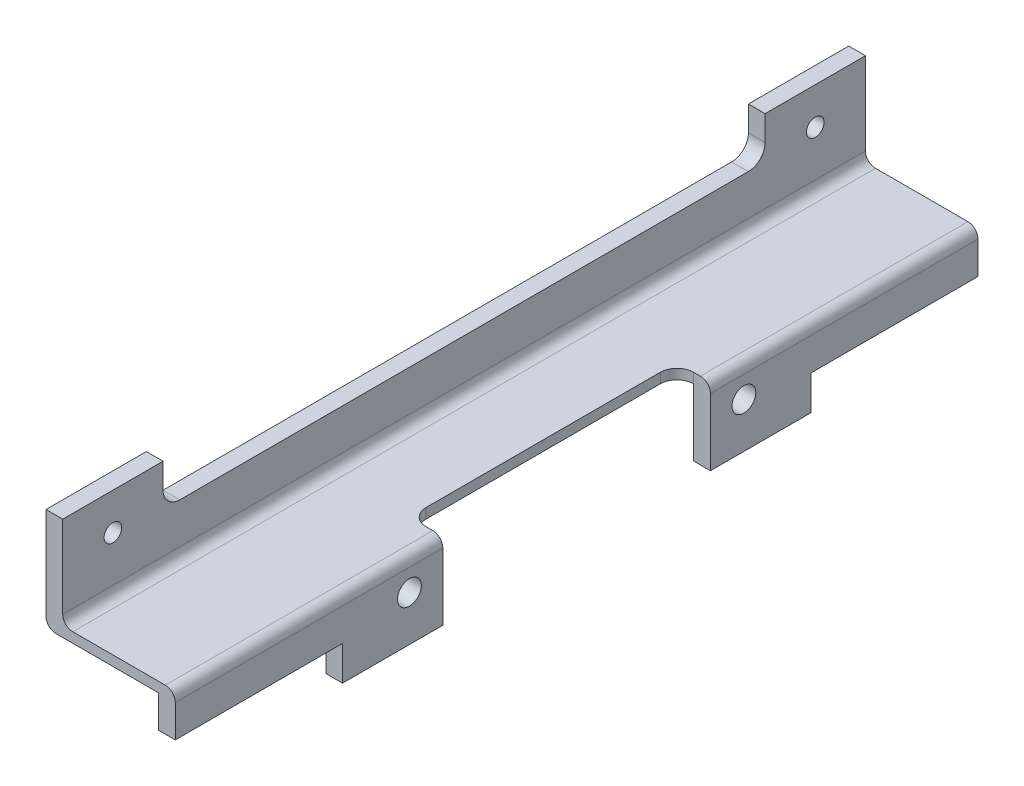
ISO-10303-21;
HEADER;
FILE_DESCRIPTION(('STEP AP214'),'2;1');
FILE_NAME('part.step','',(''),(''),'','','');
FILE_SCHEMA(('AUTOMOTIVE_DESIGN { 1 0 10303 214 1 1 1 1 }'));
ENDSEC;
DATA;
#1=APPLICATION_CONTEXT('core data for automotive mechanical design processes');
#2=APPLICATION_PROTOCOL_DEFINITION('international standard','automotive_design',2000,#1);
#3=PRODUCT_CONTEXT('',#1,'mechanical');
#4=PRODUCT('Part','Part','',(#3));
#5=PRODUCT_RELATED_PRODUCT_CATEGORY('part','',(#4));
#6=PRODUCT_DEFINITION_FORMATION('','',#4);
#7=PRODUCT_DEFINITION_CONTEXT('part definition',#1,'design');
#8=PRODUCT_DEFINITION('design','',#6,#7);
#9=PRODUCT_DEFINITION_SHAPE('','',#8);
#10=(LENGTH_UNIT() NAMED_UNIT(*) SI_UNIT(.MILLI.,.METRE.));
#11=(NAMED_UNIT(*) PLANE_ANGLE_UNIT() SI_UNIT($,.RADIAN.));
#12=(NAMED_UNIT(*) SI_UNIT($,.STERADIAN.) SOLID_ANGLE_UNIT());
#13=UNCERTAINTY_MEASURE_WITH_UNIT(LENGTH_MEASURE(1.E-05),#10,'distance_accuracy_value','');
#14=(GEOMETRIC_REPRESENTATION_CONTEXT(3) GLOBAL_UNCERTAINTY_ASSIGNED_CONTEXT((#13)) GLOBAL_UNIT_ASSIGNED_CONTEXT((#10,
#11,#12)) REPRESENTATION_CONTEXT('',''));
#15=CARTESIAN_POINT('',(0.,0.,0.));
#16=DIRECTION('',(0.,0.,1.));
#17=DIRECTION('',(1.,0.,0.));
#18=AXIS2_PLACEMENT_3D('',#15,#16,#17);
#19=CARTESIAN_POINT('',(6.35,50.8,-240.));
#20=DIRECTION('',(0.,0.,-1.));
#21=DIRECTION('',(-1.,0.,0.));
#22=AXIS2_PLACEMENT_3D('',#19,#20,#21);
#23=PLANE('',#22);
#24=DIRECTION('',(1.,0.,0.));
#25=VECTOR('',#24,1.);
#26=CARTESIAN_POINT('',(0.,6.35,-240.));
#27=LINE('',#26,#25);
#28=CARTESIAN_POINT('',(37.,6.35,-240.));
#29=VERTEX_POINT('',#28);
#30=CARTESIAN_POINT('',(9.35,6.35,-240.));
#31=VERTEX_POINT('',#30);
#32=EDGE_CURVE('E613',#29,#31,#27,.F.);
#33=ORIENTED_EDGE('',*,*,#32,.F.);
#34=CARTESIAN_POINT('',(37.,3.35,-240.));
#35=DIRECTION('',(0.,0.,-1.));
#36=DIRECTION('',(-1.,0.,0.));
#37=AXIS2_PLACEMENT_3D('',#34,#35,#36);
#38=CIRCLE('',#37,3.);
#39=CARTESIAN_POINT('',(40.,3.35,-240.));
#40=VERTEX_POINT('',#39);
#41=EDGE_CURVE('E263',#29,#40,#38,.T.);
#42=ORIENTED_EDGE('',*,*,#41,.T.);
#43=DIRECTION('',(0.,1.,0.));
#44=VECTOR('',#43,1.);
#45=CARTESIAN_POINT('',(40.,6.35,-240.));
#46=LINE('',#45,#44);
#47=CARTESIAN_POINT('',(40.,-6.35,-240.));
#48=VERTEX_POINT('',#47);
#49=EDGE_CURVE('E256',#48,#40,#46,.T.);
#50=ORIENTED_EDGE('',*,*,#49,.F.);
#51=DIRECTION('',(-1.,0.,0.));
#52=VECTOR('',#51,1.);
#53=CARTESIAN_POINT('',(40.,-6.35,-240.));
#54=LINE('',#53,#52);
#55=CARTESIAN_POINT('',(35.,-6.35,-240.));
#56=VERTEX_POINT('',#55);
#57=EDGE_CURVE('E237',#48,#56,#54,.T.);
#58=ORIENTED_EDGE('',*,*,#57,.T.);
#59=DIRECTION('',(0.,-1.,0.));
#60=VECTOR('',#59,1.);
#61=CARTESIAN_POINT('',(35.,6.35,-240.));
#62=LINE('',#61,#60);
#63=CARTESIAN_POINT('',(35.,3.35,-240.));
#64=VERTEX_POINT('',#63);
#65=EDGE_CURVE('E279',#64,#56,#62,.T.);
#66=ORIENTED_EDGE('',*,*,#65,.F.);
#67=DIRECTION('',(1.,0.,0.));
#68=VECTOR('',#67,1.);
#69=CARTESIAN_POINT('',(32.,3.35,-240.));
#70=LINE('',#69,#68);
#71=CARTESIAN_POINT('',(4.35,3.35,-240.));
#72=VERTEX_POINT('',#71);
#73=EDGE_CURVE('E398',#72,#64,#70,.T.);
#74=ORIENTED_EDGE('',*,*,#73,.F.);
#75=CARTESIAN_POINT('',(4.35,6.35,-240.));
#76=DIRECTION('',(0.,0.,-1.));
#77=DIRECTION('',(-1.,0.,0.));
#78=AXIS2_PLACEMENT_3D('',#75,#76,#77);
#79=CIRCLE('',#78,3.);
#80=CARTESIAN_POINT('',(1.35,6.35,-240.));
#81=VERTEX_POINT('',#80);
#82=EDGE_CURVE('E397',#72,#81,#79,.T.);
#83=ORIENTED_EDGE('',*,*,#82,.T.);
#84=DIRECTION('',(0.,-1.,0.));
#85=VECTOR('',#84,1.);
#86=CARTESIAN_POINT('',(1.35,0.,-240.));
#87=LINE('',#86,#85);
#88=CARTESIAN_POINT('',(1.35,34.,-240.));
#89=VERTEX_POINT('',#88);
#90=EDGE_CURVE('E450',#89,#81,#87,.T.);
#91=ORIENTED_EDGE('',*,*,#90,.F.);
#92=DIRECTION('',(-1.,0.,0.));
#93=VECTOR('',#92,1.);
#94=CARTESIAN_POINT('',(6.35,34.,-240.));
#95=LINE('',#94,#93);
#96=CARTESIAN_POINT('',(6.35,34.,-240.));
#97=VERTEX_POINT('',#96);
#98=EDGE_CURVE('E601',#97,#89,#95,.T.);
#99=ORIENTED_EDGE('',*,*,#98,.F.);
#100=DIRECTION('',(0.,1.,0.));
#101=VECTOR('',#100,1.);
#102=CARTESIAN_POINT('',(6.35,0.,-240.));
#103=LINE('',#102,#101);
#104=CARTESIAN_POINT('',(6.35,9.35,-240.));
#105=VERTEX_POINT('',#104);
#106=EDGE_CURVE('E610',#105,#97,#103,.T.);
#107=ORIENTED_EDGE('',*,*,#106,.F.);
#108=CARTESIAN_POINT('',(9.35,9.35,-240.));
#109=DIRECTION('',(0.,0.,-1.));
#110=DIRECTION('',(-1.,0.,0.));
#111=AXIS2_PLACEMENT_3D('',#108,#109,#110);
#112=CIRCLE('',#111,3.);
#113=EDGE_CURVE('E623',#105,#31,#112,.F.);
#114=ORIENTED_EDGE('',*,*,#113,.T.);
#115=EDGE_LOOP('',(#33,#42,#50,#58,#66,#74,#83,#91,#99,#107,#114));
#116=FACE_BOUND('',#115,.T.);
#117=ADVANCED_FACE('F47',(#116),#23,.T.);
#118=CARTESIAN_POINT('',(35.,6.35,-263.53720459188));
#119=DIRECTION('',(-1.,0.,0.));
#120=DIRECTION('',(0.,0.,1.));
#121=AXIS2_PLACEMENT_3D('',#118,#119,#120);
#122=PLANE('',#121);
#123=CARTESIAN_POINT('',(35.,-3.15,-170.));
#124=DIRECTION('',(-1.,0.,0.));
#125=DIRECTION('',(0.,0.,1.));
#126=AXIS2_PLACEMENT_3D('',#123,#124,#125);
#127=CIRCLE('',#126,3.56870000000001);
#128=CARTESIAN_POINT('',(35.,-3.15,-166.4313));
#129=VERTEX_POINT('',#128);
#130=EDGE_CURVE('E290',#129,#129,#127,.T.);
#131=ORIENTED_EDGE('',*,*,#130,.F.);
#132=EDGE_LOOP('',(#131));
#133=FACE_BOUND('',#132,.T.);
#134=ORIENTED_EDGE('',*,*,#65,.T.);
#135=DIRECTION('',(0.,0.,1.));
#136=VECTOR('',#135,1.);
#137=CARTESIAN_POINT('',(35.,-6.35,-263.53720459188));
#138=LINE('',#137,#136);
#139=CARTESIAN_POINT('',(35.,-6.35000000000001,-190.));
#140=VERTEX_POINT('',#139);
#141=EDGE_CURVE('E244',#56,#140,#138,.T.);
#142=ORIENTED_EDGE('',*,*,#141,.T.);
#143=DIRECTION('',(0.,-1.,0.));
#144=VECTOR('',#143,1.);
#145=CARTESIAN_POINT('',(35.,6.35,-190.));
#146=LINE('',#145,#144);
#147=CARTESIAN_POINT('',(35.,-16.65,-190.));
#148=VERTEX_POINT('',#147);
#149=EDGE_CURVE('E249',#140,#148,#146,.T.);
#150=ORIENTED_EDGE('',*,*,#149,.T.);
#151=DIRECTION('',(0.,0.,1.));
#152=VECTOR('',#151,1.);
#153=CARTESIAN_POINT('',(35.,-16.65,-263.53720459188));
#154=LINE('',#153,#152);
#155=CARTESIAN_POINT('',(35.,-16.65,-160.));
#156=VERTEX_POINT('',#155);
#157=EDGE_CURVE('E283',#148,#156,#154,.T.);
#158=ORIENTED_EDGE('',*,*,#157,.T.);
#159=DIRECTION('',(0.,-1.,0.));
#160=VECTOR('',#159,1.);
#161=CARTESIAN_POINT('',(35.,6.35,-160.));
#162=LINE('',#161,#160);
#163=CARTESIAN_POINT('',(35.,3.35,-160.));
#164=VERTEX_POINT('',#163);
#165=EDGE_CURVE('E315',#164,#156,#162,.T.);
#166=ORIENTED_EDGE('',*,*,#165,.F.);
#167=DIRECTION('',(0.,0.,-1.));
#168=VECTOR('',#167,1.);
#169=CARTESIAN_POINT('',(35.,3.35,-240.));
#170=LINE('',#169,#168);
#171=EDGE_CURVE('E264',#164,#64,#170,.T.);
#172=ORIENTED_EDGE('',*,*,#171,.T.);
#173=EDGE_LOOP('',(#134,#142,#150,#158,#166,#172));
#174=FACE_BOUND('',#173,.T.);
#175=ADVANCED_FACE('F464',(#133,#174),#122,.T.);
#176=CARTESIAN_POINT('',(40.,-16.65,-263.53720459188));
#177=DIRECTION('',(0.,-1.,0.));
#178=DIRECTION('',(0.,0.,-1.));
#179=AXIS2_PLACEMENT_3D('',#176,#177,#178);
#180=PLANE('',#179);
#181=ORIENTED_EDGE('',*,*,#157,.F.);
#182=DIRECTION('',(-1.,0.,0.));
#183=VECTOR('',#182,1.);
#184=CARTESIAN_POINT('',(40.,-16.65,-190.));
#185=LINE('',#184,#183);
#186=CARTESIAN_POINT('',(40.,-16.65,-190.));
#187=VERTEX_POINT('',#186);
#188=EDGE_CURVE('E343',#187,#148,#185,.T.);
#189=ORIENTED_EDGE('',*,*,#188,.F.);
#190=DIRECTION('',(0.,0.,1.));
#191=VECTOR('',#190,1.);
#192=CARTESIAN_POINT('',(40.,-16.65,-263.53720459188));
#193=LINE('',#192,#191);
#194=CARTESIAN_POINT('',(40.,-16.65,-160.));
#195=VERTEX_POINT('',#194);
#196=EDGE_CURVE('E265',#187,#195,#193,.T.);
#197=ORIENTED_EDGE('',*,*,#196,.T.);
#198=DIRECTION('',(1.,0.,0.));
#199=VECTOR('',#198,1.);
#200=CARTESIAN_POINT('',(40.,-16.65,-160.));
#201=LINE('',#200,#199);
#202=EDGE_CURVE('E318',#156,#195,#201,.T.);
#203=ORIENTED_EDGE('',*,*,#202,.F.);
#204=EDGE_LOOP('',(#181,#189,#197,#203));
#205=FACE_BOUND('',#204,.T.);
#206=ADVANCED_FACE('F350',(#205),#180,.T.);
#207=CARTESIAN_POINT('',(40.,6.35,-263.53720459188));
#208=DIRECTION('',(1.,0.,0.));
#209=DIRECTION('',(0.,0.,-1.));
#210=AXIS2_PLACEMENT_3D('',#207,#208,#209);
#211=PLANE('',#210);
#212=CARTESIAN_POINT('',(40.,-3.15,-170.));
#213=DIRECTION('',(1.,0.,0.));
#214=DIRECTION('',(0.,0.,-1.));
#215=AXIS2_PLACEMENT_3D('',#212,#213,#214);
#216=CIRCLE('',#215,3.56870000000001);
#217=CARTESIAN_POINT('',(40.,-3.15,-173.5687));
#218=VERTEX_POINT('',#217);
#219=EDGE_CURVE('E293',#218,#218,#216,.T.);
#220=ORIENTED_EDGE('',*,*,#219,.F.);
#221=EDGE_LOOP('',(#220));
#222=FACE_BOUND('',#221,.T.);
#223=ORIENTED_EDGE('',*,*,#49,.T.);
#224=DIRECTION('',(0.,0.,1.));
#225=VECTOR('',#224,1.);
#226=CARTESIAN_POINT('',(40.,3.35,-263.53720459188));
#227=LINE('',#226,#225);
#228=CARTESIAN_POINT('',(40.,3.35,-160.));
#229=VERTEX_POINT('',#228);
#230=EDGE_CURVE('E355',#40,#229,#227,.T.);
#231=ORIENTED_EDGE('',*,*,#230,.T.);
#232=DIRECTION('',(0.,1.,0.));
#233=VECTOR('',#232,1.);
#234=CARTESIAN_POINT('',(40.,6.35,-160.));
#235=LINE('',#234,#233);
#236=EDGE_CURVE('E354',#195,#229,#235,.T.);
#237=ORIENTED_EDGE('',*,*,#236,.F.);
#238=ORIENTED_EDGE('',*,*,#196,.F.);
#239=DIRECTION('',(0.,-1.,0.));
#240=VECTOR('',#239,1.);
#241=CARTESIAN_POINT('',(40.,-16.65,-190.));
#242=LINE('',#241,#240);
#243=CARTESIAN_POINT('',(40.,-6.35000000000001,-190.));
#244=VERTEX_POINT('',#243);
#245=EDGE_CURVE('E259',#244,#187,#242,.T.);
#246=ORIENTED_EDGE('',*,*,#245,.F.);
#247=DIRECTION('',(0.,0.,1.));
#248=VECTOR('',#247,1.);
#249=CARTESIAN_POINT('',(40.,-6.35,-240.));
#250=LINE('',#249,#248);
#251=EDGE_CURVE('E241',#48,#244,#250,.T.);
#252=ORIENTED_EDGE('',*,*,#251,.F.);
#253=EDGE_LOOP('',(#223,#231,#237,#238,#246,#252));
#254=FACE_BOUND('',#253,.T.);
#255=ADVANCED_FACE('F254',(#222,#254),#211,.T.);
#256=CARTESIAN_POINT('',(35.,-3.15,-70.));
#257=DIRECTION('',(-1.,0.,0.));
#258=DIRECTION('',(0.,0.,1.));
#259=AXIS2_PLACEMENT_3D('',#256,#257,#258);
#260=CIRCLE('',#259,3.5687);
#261=CARTESIAN_POINT('',(35.,-3.15,-66.4313));
#262=VERTEX_POINT('',#261);
#263=EDGE_CURVE('E296',#262,#262,#260,.T.);
#264=ORIENTED_EDGE('',*,*,#263,.F.);
#265=EDGE_LOOP('',(#264));
#266=FACE_BOUND('',#265,.T.);
#267=CARTESIAN_POINT('',(35.,-16.65,-80.));
#268=VERTEX_POINT('',#267);
#269=CARTESIAN_POINT('',(35.,-16.65,-50.));
#270=VERTEX_POINT('',#269);
#271=EDGE_CURVE('E281',#268,#270,#154,.T.);
#272=ORIENTED_EDGE('',*,*,#271,.T.);
#273=DIRECTION('',(0.,1.,0.));
#274=VECTOR('',#273,1.);
#275=CARTESIAN_POINT('',(35.,6.35,-50.));
#276=LINE('',#275,#274);
#277=CARTESIAN_POINT('',(35.,-6.35,-50.));
#278=VERTEX_POINT('',#277);
#279=EDGE_CURVE('E321',#270,#278,#276,.T.);
#280=ORIENTED_EDGE('',*,*,#279,.T.);
#281=DIRECTION('',(0.,0.,1.));
#282=VECTOR('',#281,1.);
#283=CARTESIAN_POINT('',(35.,-6.35,-263.53720459188));
#284=LINE('',#283,#282);
#285=CARTESIAN_POINT('',(35.,-6.35,0.));
#286=VERTEX_POINT('',#285);
#287=EDGE_CURVE('E324',#278,#286,#284,.T.);
#288=ORIENTED_EDGE('',*,*,#287,.T.);
#289=DIRECTION('',(0.,-1.,0.));
#290=VECTOR('',#289,1.);
#291=CARTESIAN_POINT('',(35.,6.35,0.));
#292=LINE('',#291,#290);
#293=CARTESIAN_POINT('',(35.,3.35,0.));
#294=VERTEX_POINT('',#293);
#295=EDGE_CURVE('E282',#294,#286,#292,.T.);
#296=ORIENTED_EDGE('',*,*,#295,.F.);
#297=CARTESIAN_POINT('',(35.,3.35,-80.));
#298=VERTEX_POINT('',#297);
#299=EDGE_CURVE('E268',#294,#298,#170,.T.);
#300=ORIENTED_EDGE('',*,*,#299,.T.);
#301=DIRECTION('',(0.,1.,0.));
#302=VECTOR('',#301,1.);
#303=CARTESIAN_POINT('',(35.,6.34999999999996,-80.));
#304=LINE('',#303,#302);
#305=EDGE_CURVE('E308',#268,#298,#304,.T.);
#306=ORIENTED_EDGE('',*,*,#305,.F.);
#307=EDGE_LOOP('',(#272,#280,#288,#296,#300,#306));
#308=FACE_BOUND('',#307,.T.);
#309=ADVANCED_FACE('F417',(#266,#308),#122,.T.);
#310=CARTESIAN_POINT('',(40.,-16.65,-80.));
#311=VERTEX_POINT('',#310);
#312=CARTESIAN_POINT('',(40.,-16.65,-50.));
#313=VERTEX_POINT('',#312);
#314=EDGE_CURVE('E270',#311,#313,#193,.T.);
#315=ORIENTED_EDGE('',*,*,#314,.T.);
#316=DIRECTION('',(-1.,0.,0.));
#317=VECTOR('',#316,1.);
#318=CARTESIAN_POINT('',(40.,-16.65,-50.));
#319=LINE('',#318,#317);
#320=EDGE_CURVE('E327',#313,#270,#319,.T.);
#321=ORIENTED_EDGE('',*,*,#320,.T.);
#322=ORIENTED_EDGE('',*,*,#271,.F.);
#323=DIRECTION('',(-1.,0.,0.));
#324=VECTOR('',#323,1.);
#325=CARTESIAN_POINT('',(40.,-16.65,-80.));
#326=LINE('',#325,#324);
#327=EDGE_CURVE('E311',#311,#268,#326,.T.);
#328=ORIENTED_EDGE('',*,*,#327,.F.);
#329=EDGE_LOOP('',(#315,#321,#322,#328));
#330=FACE_BOUND('',#329,.T.);
#331=ADVANCED_FACE('F544',(#330),#180,.T.);
#332=CARTESIAN_POINT('',(40.,-3.15,-70.));
#333=DIRECTION('',(1.,0.,0.));
#334=DIRECTION('',(0.,0.,-1.));
#335=AXIS2_PLACEMENT_3D('',#332,#333,#334);
#336=CIRCLE('',#335,3.5687);
#337=CARTESIAN_POINT('',(40.,-3.15,-73.5687));
#338=VERTEX_POINT('',#337);
#339=EDGE_CURVE('E299',#338,#338,#336,.T.);
#340=ORIENTED_EDGE('',*,*,#339,.F.);
#341=EDGE_LOOP('',(#340));
#342=FACE_BOUND('',#341,.T.);
#343=DIRECTION('',(0.,-1.,0.));
#344=VECTOR('',#343,1.);
#345=CARTESIAN_POINT('',(40.,6.34999999999996,-80.));
#346=LINE('',#345,#344);
#347=CARTESIAN_POINT('',(40.,3.35,-80.));
#348=VERTEX_POINT('',#347);
#349=EDGE_CURVE('E357',#348,#311,#346,.T.);
#350=ORIENTED_EDGE('',*,*,#349,.F.);
#351=DIRECTION('',(0.,0.,1.));
#352=VECTOR('',#351,1.);
#353=CARTESIAN_POINT('',(40.,3.35,-263.53720459188));
#354=LINE('',#353,#352);
#355=CARTESIAN_POINT('',(40.,3.35,0.));
#356=VERTEX_POINT('',#355);
#357=EDGE_CURVE('E441',#348,#356,#354,.T.);
#358=ORIENTED_EDGE('',*,*,#357,.T.);
#359=DIRECTION('',(0.,1.,0.));
#360=VECTOR('',#359,1.);
#361=CARTESIAN_POINT('',(40.,6.35,0.));
#362=LINE('',#361,#360);
#363=CARTESIAN_POINT('',(40.,-6.35,0.));
#364=VERTEX_POINT('',#363);
#365=EDGE_CURVE('E274',#364,#356,#362,.T.);
#366=ORIENTED_EDGE('',*,*,#365,.F.);
#367=DIRECTION('',(0.,0.,1.));
#368=VECTOR('',#367,1.);
#369=CARTESIAN_POINT('',(40.,-6.35,0.));
#370=LINE('',#369,#368);
#371=CARTESIAN_POINT('',(40.,-6.35,-50.));
#372=VERTEX_POINT('',#371);
#373=EDGE_CURVE('E335',#372,#364,#370,.T.);
#374=ORIENTED_EDGE('',*,*,#373,.F.);
#375=DIRECTION('',(0.,1.,0.));
#376=VECTOR('',#375,1.);
#377=CARTESIAN_POINT('',(40.,-16.65,-50.));
#378=LINE('',#377,#376);
#379=EDGE_CURVE('E337',#313,#372,#378,.T.);
#380=ORIENTED_EDGE('',*,*,#379,.F.);
#381=ORIENTED_EDGE('',*,*,#314,.F.);
#382=EDGE_LOOP('',(#350,#358,#366,#374,#380,#381));
#383=FACE_BOUND('',#382,.T.);
#384=ADVANCED_FACE('F498',(#342,#383),#211,.T.);
#385=CARTESIAN_POINT('',(6.35,50.8,0.));
#386=DIRECTION('',(0.,0.,-1.));
#387=DIRECTION('',(-1.,0.,0.));
#388=AXIS2_PLACEMENT_3D('',#385,#386,#387);
#389=PLANE('',#388);
#390=ORIENTED_EDGE('',*,*,#365,.T.);
#391=CARTESIAN_POINT('',(37.,3.35,0.));
#392=DIRECTION('',(0.,0.,-1.));
#393=DIRECTION('',(-1.,0.,0.));
#394=AXIS2_PLACEMENT_3D('',#391,#392,#393);
#395=CIRCLE('',#394,3.);
#396=CARTESIAN_POINT('',(37.,6.35,0.));
#397=VERTEX_POINT('',#396);
#398=EDGE_CURVE('E438',#356,#397,#395,.F.);
#399=ORIENTED_EDGE('',*,*,#398,.T.);
#400=DIRECTION('',(1.,0.,0.));
#401=VECTOR('',#400,1.);
#402=CARTESIAN_POINT('',(0.,6.35,0.));
#403=LINE('',#402,#401);
#404=CARTESIAN_POINT('',(9.35,6.35,0.));
#405=VERTEX_POINT('',#404);
#406=EDGE_CURVE('E434',#397,#405,#403,.F.);
#407=ORIENTED_EDGE('',*,*,#406,.T.);
#408=CARTESIAN_POINT('',(9.35,9.35,0.));
#409=DIRECTION('',(0.,0.,-1.));
#410=DIRECTION('',(-1.,0.,0.));
#411=AXIS2_PLACEMENT_3D('',#408,#409,#410);
#412=CIRCLE('',#411,3.);
#413=CARTESIAN_POINT('',(6.35,9.35,0.));
#414=VERTEX_POINT('',#413);
#415=EDGE_CURVE('E621',#405,#414,#412,.T.);
#416=ORIENTED_EDGE('',*,*,#415,.T.);
#417=DIRECTION('',(0.,1.,0.));
#418=VECTOR('',#417,1.);
#419=CARTESIAN_POINT('',(6.35,0.,0.));
#420=LINE('',#419,#418);
#421=CARTESIAN_POINT('',(6.35,34.,0.));
#422=VERTEX_POINT('',#421);
#423=EDGE_CURVE('E604',#414,#422,#420,.T.);
#424=ORIENTED_EDGE('',*,*,#423,.T.);
#425=DIRECTION('',(-1.,0.,0.));
#426=VECTOR('',#425,1.);
#427=CARTESIAN_POINT('',(6.35,34.,0.));
#428=LINE('',#427,#426);
#429=CARTESIAN_POINT('',(1.35,34.,0.));
#430=VERTEX_POINT('',#429);
#431=EDGE_CURVE('E597',#422,#430,#428,.T.);
#432=ORIENTED_EDGE('',*,*,#431,.T.);
#433=DIRECTION('',(0.,1.,0.));
#434=VECTOR('',#433,1.);
#435=CARTESIAN_POINT('',(1.35,0.,0.));
#436=LINE('',#435,#434);
#437=CARTESIAN_POINT('',(1.35,6.35,0.));
#438=VERTEX_POINT('',#437);
#439=EDGE_CURVE('E401',#438,#430,#436,.T.);
#440=ORIENTED_EDGE('',*,*,#439,.F.);
#441=CARTESIAN_POINT('',(4.35,6.35,0.));
#442=DIRECTION('',(0.,0.,-1.));
#443=DIRECTION('',(-1.,0.,0.));
#444=AXIS2_PLACEMENT_3D('',#441,#442,#443);
#445=CIRCLE('',#444,3.);
#446=CARTESIAN_POINT('',(4.35,3.35,0.));
#447=VERTEX_POINT('',#446);
#448=EDGE_CURVE('E62',#438,#447,#445,.F.);
#449=ORIENTED_EDGE('',*,*,#448,.T.);
#450=DIRECTION('',(-1.,0.,0.));
#451=VECTOR('',#450,1.);
#452=CARTESIAN_POINT('',(32.,3.35,0.));
#453=LINE('',#452,#451);
#454=EDGE_CURVE('E402',#294,#447,#453,.T.);
#455=ORIENTED_EDGE('',*,*,#454,.F.);
#456=ORIENTED_EDGE('',*,*,#295,.T.);
#457=DIRECTION('',(-1.,0.,0.));
#458=VECTOR('',#457,1.);
#459=CARTESIAN_POINT('',(40.,-6.35,0.));
#460=LINE('',#459,#458);
#461=EDGE_CURVE('E333',#364,#286,#460,.T.);
#462=ORIENTED_EDGE('',*,*,#461,.F.);
#463=EDGE_LOOP('',(#390,#399,#407,#416,#424,#432,#440,#449,#455,#456,#462));
#464=FACE_BOUND('',#463,.T.);
#465=ADVANCED_FACE('F495',(#464),#389,.F.);
#466=CARTESIAN_POINT('',(1.35,0.,0.));
#467=DIRECTION('',(-1.,0.,0.));
#468=DIRECTION('',(0.,0.,1.));
#469=AXIS2_PLACEMENT_3D('',#466,#467,#468);
#470=PLANE('',#469);
#471=CARTESIAN_POINT('',(1.35,23.,-15.));
#472=DIRECTION('',(-1.,0.,0.));
#473=DIRECTION('',(0.,0.,1.));
#474=AXIS2_PLACEMENT_3D('',#471,#472,#473);
#475=CIRCLE('',#474,2.63779);
#476=CARTESIAN_POINT('',(1.35,23.,-12.36221));
#477=VERTEX_POINT('',#476);
#478=EDGE_CURVE('E456',#477,#477,#475,.F.);
#479=ORIENTED_EDGE('',*,*,#478,.T.);
#480=EDGE_LOOP('',(#479));
#481=FACE_BOUND('',#480,.T.);
#482=CARTESIAN_POINT('',(1.35,23.,-225.));
#483=DIRECTION('',(-1.,0.,0.));
#484=DIRECTION('',(0.,0.,1.));
#485=AXIS2_PLACEMENT_3D('',#482,#483,#484);
#486=CIRCLE('',#485,2.63779);
#487=CARTESIAN_POINT('',(1.35,23.,-222.36221));
#488=VERTEX_POINT('',#487);
#489=EDGE_CURVE('E628',#488,#488,#486,.F.);
#490=ORIENTED_EDGE('',*,*,#489,.T.);
#491=EDGE_LOOP('',(#490));
#492=FACE_BOUND('',#491,.T.);
#493=ORIENTED_EDGE('',*,*,#90,.T.);
#494=DIRECTION('',(0.,0.,-1.));
#495=VECTOR('',#494,1.);
#496=CARTESIAN_POINT('',(1.35,6.35,0.));
#497=LINE('',#496,#495);
#498=EDGE_CURVE('E12',#81,#438,#497,.F.);
#499=ORIENTED_EDGE('',*,*,#498,.T.);
#500=ORIENTED_EDGE('',*,*,#439,.T.);
#501=DIRECTION('',(0.,0.,-1.));
#502=VECTOR('',#501,1.);
#503=CARTESIAN_POINT('',(1.35,34.,0.));
#504=LINE('',#503,#502);
#505=CARTESIAN_POINT('',(1.35,34.,-30.));
#506=VERTEX_POINT('',#505);
#507=EDGE_CURVE('E457',#430,#506,#504,.T.);
#508=ORIENTED_EDGE('',*,*,#507,.T.);
#509=DIRECTION('',(0.,-1.,0.));
#510=VECTOR('',#509,1.);
#511=CARTESIAN_POINT('',(1.35,51.5,-30.));
#512=LINE('',#511,#510);
#513=CARTESIAN_POINT('',(1.35,26.5,-30.));
#514=VERTEX_POINT('',#513);
#515=EDGE_CURVE('E583',#506,#514,#512,.T.);
#516=ORIENTED_EDGE('',*,*,#515,.T.);
#517=CARTESIAN_POINT('',(1.35,26.5,-35.));
#518=DIRECTION('',(-1.,0.,0.));
#519=DIRECTION('',(0.,0.,1.));
#520=AXIS2_PLACEMENT_3D('',#517,#518,#519);
#521=CIRCLE('',#520,5.);
#522=CARTESIAN_POINT('',(1.35,21.5,-35.));
#523=VERTEX_POINT('',#522);
#524=EDGE_CURVE('E631',#514,#523,#521,.F.);
#525=ORIENTED_EDGE('',*,*,#524,.T.);
#526=DIRECTION('',(0.,0.,-1.));
#527=VECTOR('',#526,1.);
#528=CARTESIAN_POINT('',(1.35,21.5,-35.));
#529=LINE('',#528,#527);
#530=CARTESIAN_POINT('',(1.35,21.5,-205.));
#531=VERTEX_POINT('',#530);
#532=EDGE_CURVE('E635',#523,#531,#529,.T.);
#533=ORIENTED_EDGE('',*,*,#532,.T.);
#534=CARTESIAN_POINT('',(1.35,26.5,-205.));
#535=DIRECTION('',(-1.,0.,0.));
#536=DIRECTION('',(0.,0.,1.));
#537=AXIS2_PLACEMENT_3D('',#534,#535,#536);
#538=CIRCLE('',#537,5.);
#539=CARTESIAN_POINT('',(1.35,26.5,-210.));
#540=VERTEX_POINT('',#539);
#541=EDGE_CURVE('E640',#531,#540,#538,.F.);
#542=ORIENTED_EDGE('',*,*,#541,.T.);
#543=DIRECTION('',(0.,1.,0.));
#544=VECTOR('',#543,1.);
#545=CARTESIAN_POINT('',(1.35,51.5,-210.));
#546=LINE('',#545,#544);
#547=CARTESIAN_POINT('',(1.35,34.,-210.));
#548=VERTEX_POINT('',#547);
#549=EDGE_CURVE('E589',#540,#548,#546,.T.);
#550=ORIENTED_EDGE('',*,*,#549,.T.);
#551=EDGE_CURVE('E455',#548,#89,#504,.T.);
#552=ORIENTED_EDGE('',*,*,#551,.T.);
#553=EDGE_LOOP('',(#493,#499,#500,#508,#516,#525,#533,#542,#550,#552));
#554=FACE_BOUND('',#553,.T.);
#555=ADVANCED_FACE('F453',(#481,#492,#554),#470,.T.);
#556=CARTESIAN_POINT('',(0.,34.,5.));
#557=DIRECTION('',(0.,-1.,0.));
#558=DIRECTION('',(0.,0.,-1.));
#559=AXIS2_PLACEMENT_3D('',#556,#557,#558);
#560=PLANE('',#559);
#561=ORIENTED_EDGE('',*,*,#507,.F.);
#562=ORIENTED_EDGE('',*,*,#431,.F.);
#563=DIRECTION('',(0.,0.,-1.));
#564=VECTOR('',#563,1.);
#565=CARTESIAN_POINT('',(6.35,34.,5.));
#566=LINE('',#565,#564);
#567=CARTESIAN_POINT('',(6.35,34.,-30.));
#568=VERTEX_POINT('',#567);
#569=EDGE_CURVE('E596',#422,#568,#566,.T.);
#570=ORIENTED_EDGE('',*,*,#569,.T.);
#571=DIRECTION('',(-1.,0.,0.));
#572=VECTOR('',#571,1.);
#573=CARTESIAN_POINT('',(0.,34.,-30.));
#574=LINE('',#573,#572);
#575=EDGE_CURVE('E358',#568,#506,#574,.T.);
#576=ORIENTED_EDGE('',*,*,#575,.T.);
#577=EDGE_LOOP('',(#561,#562,#570,#576));
#578=FACE_BOUND('',#577,.T.);
#579=ADVANCED_FACE('F493',(#578),#560,.F.);
#580=ORIENTED_EDGE('',*,*,#551,.F.);
#581=DIRECTION('',(1.,0.,0.));
#582=VECTOR('',#581,1.);
#583=CARTESIAN_POINT('',(0.,34.,-210.));
#584=LINE('',#583,#582);
#585=CARTESIAN_POINT('',(6.35,34.,-210.));
#586=VERTEX_POINT('',#585);
#587=EDGE_CURVE('E363',#548,#586,#584,.T.);
#588=ORIENTED_EDGE('',*,*,#587,.T.);
#589=EDGE_CURVE('E602',#586,#97,#566,.T.);
#590=ORIENTED_EDGE('',*,*,#589,.T.);
#591=ORIENTED_EDGE('',*,*,#98,.T.);
#592=EDGE_LOOP('',(#580,#588,#590,#591));
#593=FACE_BOUND('',#592,.T.);
#594=ADVANCED_FACE('F575',(#593),#560,.F.);
#595=CARTESIAN_POINT('',(0.,51.5,-30.));
#596=DIRECTION('',(0.,0.,1.));
#597=DIRECTION('',(0.,-1.,0.));
#598=AXIS2_PLACEMENT_3D('',#595,#596,#597);
#599=PLANE('',#598);
#600=ORIENTED_EDGE('',*,*,#515,.F.);
#601=ORIENTED_EDGE('',*,*,#575,.F.);
#602=DIRECTION('',(0.,-1.,0.));
#603=VECTOR('',#602,1.);
#604=CARTESIAN_POINT('',(6.35,51.5,-30.));
#605=LINE('',#604,#603);
#606=CARTESIAN_POINT('',(6.35,26.5,-30.));
#607=VERTEX_POINT('',#606);
#608=EDGE_CURVE('E648',#568,#607,#605,.T.);
#609=ORIENTED_EDGE('',*,*,#608,.T.);
#610=DIRECTION('',(1.,0.,0.));
#611=VECTOR('',#610,1.);
#612=CARTESIAN_POINT('',(0.,26.5,-30.));
#613=LINE('',#612,#611);
#614=EDGE_CURVE('E586',#514,#607,#613,.T.);
#615=ORIENTED_EDGE('',*,*,#614,.F.);
#616=EDGE_LOOP('',(#600,#601,#609,#615));
#617=FACE_BOUND('',#616,.T.);
#618=ADVANCED_FACE('F563',(#617),#599,.F.);
#619=CARTESIAN_POINT('',(0.,51.5,-210.));
#620=DIRECTION('',(0.,0.,-1.));
#621=DIRECTION('',(-1.,0.,0.));
#622=AXIS2_PLACEMENT_3D('',#619,#620,#621);
#623=PLANE('',#622);
#624=ORIENTED_EDGE('',*,*,#549,.F.);
#625=DIRECTION('',(1.,0.,0.));
#626=VECTOR('',#625,1.);
#627=CARTESIAN_POINT('',(0.,26.5,-210.));
#628=LINE('',#627,#626);
#629=CARTESIAN_POINT('',(6.35,26.5,-210.));
#630=VERTEX_POINT('',#629);
#631=EDGE_CURVE('E606',#540,#630,#628,.T.);
#632=ORIENTED_EDGE('',*,*,#631,.T.);
#633=DIRECTION('',(0.,1.,0.));
#634=VECTOR('',#633,1.);
#635=CARTESIAN_POINT('',(6.35,51.5,-210.));
#636=LINE('',#635,#634);
#637=EDGE_CURVE('E659',#630,#586,#636,.T.);
#638=ORIENTED_EDGE('',*,*,#637,.T.);
#639=ORIENTED_EDGE('',*,*,#587,.F.);
#640=EDGE_LOOP('',(#624,#632,#638,#639));
#641=FACE_BOUND('',#640,.T.);
#642=ADVANCED_FACE('F559',(#641),#623,.F.);
#643=CARTESIAN_POINT('',(0.,26.5,-205.));
#644=DIRECTION('',(1.,0.,0.));
#645=DIRECTION('',(0.,0.,-1.));
#646=AXIS2_PLACEMENT_3D('',#643,#644,#645);
#647=CYLINDRICAL_SURFACE('',#646,5.);
#648=ORIENTED_EDGE('',*,*,#541,.F.);
#649=DIRECTION('',(1.,0.,0.));
#650=VECTOR('',#649,1.);
#651=CARTESIAN_POINT('',(0.,21.5,-205.));
#652=LINE('',#651,#650);
#653=CARTESIAN_POINT('',(6.35,21.5,-205.));
#654=VERTEX_POINT('',#653);
#655=EDGE_CURVE('E663',#531,#654,#652,.T.);
#656=ORIENTED_EDGE('',*,*,#655,.T.);
#657=CARTESIAN_POINT('',(6.35,26.5,-205.));
#658=DIRECTION('',(1.,0.,0.));
#659=DIRECTION('',(0.,0.,1.));
#660=AXIS2_PLACEMENT_3D('',#657,#658,#659);
#661=CIRCLE('',#660,5.);
#662=EDGE_CURVE('E656',#654,#630,#661,.T.);
#663=ORIENTED_EDGE('',*,*,#662,.T.);
#664=ORIENTED_EDGE('',*,*,#631,.F.);
#665=EDGE_LOOP('',(#648,#656,#663,#664));
#666=FACE_BOUND('',#665,.T.);
#667=ADVANCED_FACE('F562',(#666),#647,.F.);
#668=CARTESIAN_POINT('',(0.,21.5,-35.));
#669=DIRECTION('',(0.,-1.,0.));
#670=DIRECTION('',(0.,0.,-1.));
#671=AXIS2_PLACEMENT_3D('',#668,#669,#670);
#672=PLANE('',#671);
#673=ORIENTED_EDGE('',*,*,#532,.F.);
#674=DIRECTION('',(1.,0.,0.));
#675=VECTOR('',#674,1.);
#676=CARTESIAN_POINT('',(0.,21.5,-35.));
#677=LINE('',#676,#675);
#678=CARTESIAN_POINT('',(6.35,21.5,-35.));
#679=VERTEX_POINT('',#678);
#680=EDGE_CURVE('E664',#523,#679,#677,.T.);
#681=ORIENTED_EDGE('',*,*,#680,.T.);
#682=DIRECTION('',(0.,0.,-1.));
#683=VECTOR('',#682,1.);
#684=CARTESIAN_POINT('',(6.35,21.5,-35.));
#685=LINE('',#684,#683);
#686=EDGE_CURVE('E653',#679,#654,#685,.T.);
#687=ORIENTED_EDGE('',*,*,#686,.T.);
#688=ORIENTED_EDGE('',*,*,#655,.F.);
#689=EDGE_LOOP('',(#673,#681,#687,#688));
#690=FACE_BOUND('',#689,.T.);
#691=ADVANCED_FACE('F567',(#690),#672,.F.);
#692=CARTESIAN_POINT('',(0.,26.5,-35.));
#693=DIRECTION('',(1.,0.,0.));
#694=DIRECTION('',(0.,0.,-1.));
#695=AXIS2_PLACEMENT_3D('',#692,#693,#694);
#696=CYLINDRICAL_SURFACE('',#695,5.);
#697=ORIENTED_EDGE('',*,*,#524,.F.);
#698=ORIENTED_EDGE('',*,*,#614,.T.);
#699=CARTESIAN_POINT('',(6.35,26.5,-35.));
#700=DIRECTION('',(1.,0.,0.));
#701=DIRECTION('',(0.,0.,1.));
#702=AXIS2_PLACEMENT_3D('',#699,#700,#701);
#703=CIRCLE('',#702,5.);
#704=EDGE_CURVE('E650',#607,#679,#703,.T.);
#705=ORIENTED_EDGE('',*,*,#704,.T.);
#706=ORIENTED_EDGE('',*,*,#680,.F.);
#707=EDGE_LOOP('',(#697,#698,#705,#706));
#708=FACE_BOUND('',#707,.T.);
#709=ADVANCED_FACE('F557',(#708),#696,.F.);
#710=CARTESIAN_POINT('',(6.35,23.,-225.));
#711=DIRECTION('',(1.,0.,0.));
#712=DIRECTION('',(0.,0.,-1.));
#713=AXIS2_PLACEMENT_3D('',#710,#711,#712);
#714=CYLINDRICAL_SURFACE('',#713,2.63779);
#715=CARTESIAN_POINT('',(6.35,23.,-225.));
#716=DIRECTION('',(1.,0.,0.));
#717=DIRECTION('',(0.,0.,-1.));
#718=AXIS2_PLACEMENT_3D('',#715,#716,#717);
#719=CIRCLE('',#718,2.63778999999999);
#720=CARTESIAN_POINT('',(6.35,23.,-227.63779));
#721=VERTEX_POINT('',#720);
#722=EDGE_CURVE('E645',#721,#721,#719,.T.);
#723=ORIENTED_EDGE('',*,*,#722,.T.);
#724=EDGE_LOOP('',(#723));
#725=FACE_BOUND('',#724,.T.);
#726=ORIENTED_EDGE('',*,*,#489,.F.);
#727=EDGE_LOOP('',(#726));
#728=FACE_BOUND('',#727,.T.);
#729=ADVANCED_FACE('F553',(#725,#728),#714,.F.);
#730=CARTESIAN_POINT('',(6.35,23.,-15.));
#731=DIRECTION('',(1.,0.,0.));
#732=DIRECTION('',(0.,0.,-1.));
#733=AXIS2_PLACEMENT_3D('',#730,#731,#732);
#734=CYLINDRICAL_SURFACE('',#733,2.63779);
#735=CARTESIAN_POINT('',(6.35,23.,-15.));
#736=DIRECTION('',(1.,0.,0.));
#737=DIRECTION('',(0.,0.,-1.));
#738=AXIS2_PLACEMENT_3D('',#735,#736,#737);
#739=CIRCLE('',#738,2.63778999999999);
#740=CARTESIAN_POINT('',(6.35,23.,-17.63779));
#741=VERTEX_POINT('',#740);
#742=EDGE_CURVE('E588',#741,#741,#739,.T.);
#743=ORIENTED_EDGE('',*,*,#742,.T.);
#744=EDGE_LOOP('',(#743));
#745=FACE_BOUND('',#744,.T.);
#746=ORIENTED_EDGE('',*,*,#478,.F.);
#747=EDGE_LOOP('',(#746));
#748=FACE_BOUND('',#747,.T.);
#749=ADVANCED_FACE('F505',(#745,#748),#734,.F.);
#750=CARTESIAN_POINT('',(6.35,0.,-240.));
#751=DIRECTION('',(1.,0.,0.));
#752=DIRECTION('',(0.,0.,-1.));
#753=AXIS2_PLACEMENT_3D('',#750,#751,#752);
#754=PLANE('',#753);
#755=ORIENTED_EDGE('',*,*,#742,.F.);
#756=EDGE_LOOP('',(#755));
#757=FACE_BOUND('',#756,.T.);
#758=ORIENTED_EDGE('',*,*,#722,.F.);
#759=EDGE_LOOP('',(#758));
#760=FACE_BOUND('',#759,.T.);
#761=ORIENTED_EDGE('',*,*,#608,.F.);
#762=ORIENTED_EDGE('',*,*,#569,.F.);
#763=ORIENTED_EDGE('',*,*,#423,.F.);
#764=DIRECTION('',(0.,0.,1.));
#765=VECTOR('',#764,1.);
#766=CARTESIAN_POINT('',(6.35,9.35,-240.));
#767=LINE('',#766,#765);
#768=EDGE_CURVE('E619',#414,#105,#767,.F.);
#769=ORIENTED_EDGE('',*,*,#768,.T.);
#770=ORIENTED_EDGE('',*,*,#106,.T.);
#771=ORIENTED_EDGE('',*,*,#589,.F.);
#772=ORIENTED_EDGE('',*,*,#637,.F.);
#773=ORIENTED_EDGE('',*,*,#662,.F.);
#774=ORIENTED_EDGE('',*,*,#686,.F.);
#775=ORIENTED_EDGE('',*,*,#704,.F.);
#776=EDGE_LOOP('',(#761,#762,#763,#769,#770,#771,#772,#773,#774,#775));
#777=FACE_BOUND('',#776,.T.);
#778=ADVANCED_FACE('F502',(#757,#760,#777),#754,.T.);
#779=CARTESIAN_POINT('',(0.,6.35,-240.));
#780=DIRECTION('',(0.,1.,0.));
#781=DIRECTION('',(0.,0.,1.));
#782=AXIS2_PLACEMENT_3D('',#779,#780,#781);
#783=PLANE('',#782);
#784=DIRECTION('',(-1.,0.,0.));
#785=VECTOR('',#784,1.);
#786=CARTESIAN_POINT('',(0.,6.35,-160.));
#787=LINE('',#786,#785);
#788=CARTESIAN_POINT('',(37.,6.35,-160.));
#789=VERTEX_POINT('',#788);
#790=CARTESIAN_POINT('',(35.,6.35,-160.));
#791=VERTEX_POINT('',#790);
#792=EDGE_CURVE('E313',#789,#791,#787,.T.);
#793=ORIENTED_EDGE('',*,*,#792,.F.);
#794=DIRECTION('',(0.,0.,1.));
#795=VECTOR('',#794,1.);
#796=CARTESIAN_POINT('',(37.,6.35,-240.));
#797=LINE('',#796,#795);
#798=EDGE_CURVE('E395',#789,#29,#797,.F.);
#799=ORIENTED_EDGE('',*,*,#798,.T.);
#800=ORIENTED_EDGE('',*,*,#32,.T.);
#801=DIRECTION('',(0.,0.,1.));
#802=VECTOR('',#801,1.);
#803=CARTESIAN_POINT('',(9.35,6.35,0.));
#804=LINE('',#803,#802);
#805=EDGE_CURVE('E615',#31,#405,#804,.T.);
#806=ORIENTED_EDGE('',*,*,#805,.T.);
#807=ORIENTED_EDGE('',*,*,#406,.F.);
#808=DIRECTION('',(0.,0.,1.));
#809=VECTOR('',#808,1.);
#810=CARTESIAN_POINT('',(37.,6.35,-240.));
#811=LINE('',#810,#809);
#812=CARTESIAN_POINT('',(37.,6.35,-80.));
#813=VERTEX_POINT('',#812);
#814=EDGE_CURVE('E393',#397,#813,#811,.F.);
#815=ORIENTED_EDGE('',*,*,#814,.T.);
#816=DIRECTION('',(1.,0.,0.));
#817=VECTOR('',#816,1.);
#818=CARTESIAN_POINT('',(0.,6.35,-80.));
#819=LINE('',#818,#817);
#820=CARTESIAN_POINT('',(35.,6.35,-80.));
#821=VERTEX_POINT('',#820);
#822=EDGE_CURVE('E305',#821,#813,#819,.T.);
#823=ORIENTED_EDGE('',*,*,#822,.F.);
#824=CARTESIAN_POINT('',(35.,6.35,-85.));
#825=DIRECTION('',(0.,1.,0.));
#826=DIRECTION('',(0.,0.,1.));
#827=AXIS2_PLACEMENT_3D('',#824,#825,#826);
#828=CIRCLE('',#827,5.);
#829=CARTESIAN_POINT('',(30.,6.35,-85.));
#830=VERTEX_POINT('',#829);
#831=EDGE_CURVE('E388',#821,#830,#828,.F.);
#832=ORIENTED_EDGE('',*,*,#831,.T.);
#833=DIRECTION('',(0.,0.,-1.));
#834=VECTOR('',#833,1.);
#835=CARTESIAN_POINT('',(30.,6.35,-240.));
#836=LINE('',#835,#834);
#837=CARTESIAN_POINT('',(30.,6.35,-155.));
#838=VERTEX_POINT('',#837);
#839=EDGE_CURVE('E302',#830,#838,#836,.T.);
#840=ORIENTED_EDGE('',*,*,#839,.T.);
#841=CARTESIAN_POINT('',(35.,6.35,-155.));
#842=DIRECTION('',(0.,1.,0.));
#843=DIRECTION('',(0.,0.,1.));
#844=AXIS2_PLACEMENT_3D('',#841,#842,#843);
#845=CIRCLE('',#844,5.);
#846=EDGE_CURVE('E381',#838,#791,#845,.F.);
#847=ORIENTED_EDGE('',*,*,#846,.T.);
#848=EDGE_LOOP('',(#793,#799,#800,#806,#807,#815,#823,#832,#840,#847));
#849=FACE_BOUND('',#848,.T.);
#850=ADVANCED_FACE('F429',(#849),#783,.T.);
#851=CARTESIAN_POINT('',(9.35,9.35,-240.));
#852=DIRECTION('',(0.,0.,-1.));
#853=DIRECTION('',(-1.,0.,0.));
#854=AXIS2_PLACEMENT_3D('',#851,#852,#853);
#855=CYLINDRICAL_SURFACE('',#854,3.);
#856=ORIENTED_EDGE('',*,*,#113,.F.);
#857=ORIENTED_EDGE('',*,*,#768,.F.);
#858=ORIENTED_EDGE('',*,*,#415,.F.);
#859=ORIENTED_EDGE('',*,*,#805,.F.);
#860=EDGE_LOOP('',(#856,#857,#858,#859));
#861=FACE_BOUND('',#860,.T.);
#862=ADVANCED_FACE('F501',(#861),#855,.F.);
#863=CARTESIAN_POINT('',(32.,3.35,0.));
#864=DIRECTION('',(0.,-1.,0.));
#865=DIRECTION('',(0.,0.,-1.));
#866=AXIS2_PLACEMENT_3D('',#863,#864,#865);
#867=PLANE('',#866);
#868=ORIENTED_EDGE('',*,*,#454,.T.);
#869=DIRECTION('',(0.,0.,-1.));
#870=VECTOR('',#869,1.);
#871=CARTESIAN_POINT('',(4.35,3.35,0.));
#872=LINE('',#871,#870);
#873=EDGE_CURVE('E55',#447,#72,#872,.T.);
#874=ORIENTED_EDGE('',*,*,#873,.T.);
#875=ORIENTED_EDGE('',*,*,#73,.T.);
#876=ORIENTED_EDGE('',*,*,#171,.F.);
#877=CARTESIAN_POINT('',(35.,3.35,-155.));
#878=DIRECTION('',(0.,-1.,0.));
#879=DIRECTION('',(0.,0.,-1.));
#880=AXIS2_PLACEMENT_3D('',#877,#878,#879);
#881=CIRCLE('',#880,5.);
#882=CARTESIAN_POINT('',(30.,3.35,-155.));
#883=VERTEX_POINT('',#882);
#884=EDGE_CURVE('E384',#164,#883,#881,.F.);
#885=ORIENTED_EDGE('',*,*,#884,.T.);
#886=DIRECTION('',(0.,0.,1.));
#887=VECTOR('',#886,1.);
#888=CARTESIAN_POINT('',(30.,3.35,0.));
#889=LINE('',#888,#887);
#890=CARTESIAN_POINT('',(30.,3.35,-85.));
#891=VERTEX_POINT('',#890);
#892=EDGE_CURVE('E360',#883,#891,#889,.T.);
#893=ORIENTED_EDGE('',*,*,#892,.T.);
#894=CARTESIAN_POINT('',(35.,3.35,-85.));
#895=DIRECTION('',(0.,-1.,0.));
#896=DIRECTION('',(0.,0.,-1.));
#897=AXIS2_PLACEMENT_3D('',#894,#895,#896);
#898=CIRCLE('',#897,5.);
#899=EDGE_CURVE('E386',#891,#298,#898,.F.);
#900=ORIENTED_EDGE('',*,*,#899,.T.);
#901=ORIENTED_EDGE('',*,*,#299,.F.);
#902=EDGE_LOOP('',(#868,#874,#875,#876,#885,#893,#900,#901));
#903=FACE_BOUND('',#902,.T.);
#904=ADVANCED_FACE('F459',(#903),#867,.T.);
#905=CARTESIAN_POINT('',(1.349975,-3.15,-170.));
#906=DIRECTION('',(1.,0.,0.));
#907=DIRECTION('',(0.,0.,-1.));
#908=AXIS2_PLACEMENT_3D('',#905,#906,#907);
#909=CYLINDRICAL_SURFACE('',#908,3.56870000000001);
#910=ORIENTED_EDGE('',*,*,#130,.T.);
#911=EDGE_LOOP('',(#910));
#912=FACE_BOUND('',#911,.T.);
#913=ORIENTED_EDGE('',*,*,#219,.T.);
#914=EDGE_LOOP('',(#913));
#915=FACE_BOUND('',#914,.T.);
#916=ADVANCED_FACE('F535',(#912,#915),#909,.F.);
#917=CARTESIAN_POINT('',(1.349975,-3.15,-70.));
#918=DIRECTION('',(1.,0.,0.));
#919=DIRECTION('',(0.,0.,-1.));
#920=AXIS2_PLACEMENT_3D('',#917,#918,#919);
#921=CYLINDRICAL_SURFACE('',#920,3.5687);
#922=ORIENTED_EDGE('',*,*,#263,.T.);
#923=EDGE_LOOP('',(#922));
#924=FACE_BOUND('',#923,.T.);
#925=ORIENTED_EDGE('',*,*,#339,.T.);
#926=EDGE_LOOP('',(#925));
#927=FACE_BOUND('',#926,.T.);
#928=ADVANCED_FACE('F532',(#924,#927),#921,.F.);
#929=CARTESIAN_POINT('',(30.,34.,-80.));
#930=DIRECTION('',(0.,0.,1.));
#931=DIRECTION('',(0.,-1.,0.));
#932=AXIS2_PLACEMENT_3D('',#929,#930,#931);
#933=PLANE('',#932);
#934=ORIENTED_EDGE('',*,*,#822,.T.);
#935=CARTESIAN_POINT('',(37.,3.35,-80.));
#936=DIRECTION('',(0.,0.,1.));
#937=DIRECTION('',(0.,-1.,0.));
#938=AXIS2_PLACEMENT_3D('',#935,#936,#937);
#939=CIRCLE('',#938,3.);
#940=EDGE_CURVE('E440',#813,#348,#939,.F.);
#941=ORIENTED_EDGE('',*,*,#940,.T.);
#942=ORIENTED_EDGE('',*,*,#349,.T.);
#943=ORIENTED_EDGE('',*,*,#327,.T.);
#944=ORIENTED_EDGE('',*,*,#305,.T.);
#945=DIRECTION('',(0.,-1.,0.));
#946=VECTOR('',#945,1.);
#947=CARTESIAN_POINT('',(35.,34.,-80.));
#948=LINE('',#947,#946);
#949=EDGE_CURVE('E379',#298,#821,#948,.F.);
#950=ORIENTED_EDGE('',*,*,#949,.T.);
#951=EDGE_LOOP('',(#934,#941,#942,#943,#944,#950));
#952=FACE_BOUND('',#951,.T.);
#953=ADVANCED_FACE('F425',(#952),#933,.F.);
#954=CARTESIAN_POINT('',(30.,34.,-160.));
#955=DIRECTION('',(0.,0.,-1.));
#956=DIRECTION('',(-1.,0.,0.));
#957=AXIS2_PLACEMENT_3D('',#954,#955,#956);
#958=PLANE('',#957);
#959=ORIENTED_EDGE('',*,*,#236,.T.);
#960=CARTESIAN_POINT('',(37.,3.35,-160.));
#961=DIRECTION('',(0.,0.,-1.));
#962=DIRECTION('',(-1.,0.,0.));
#963=AXIS2_PLACEMENT_3D('',#960,#961,#962);
#964=CIRCLE('',#963,3.);
#965=EDGE_CURVE('E391',#229,#789,#964,.F.);
#966=ORIENTED_EDGE('',*,*,#965,.T.);
#967=ORIENTED_EDGE('',*,*,#792,.T.);
#968=DIRECTION('',(0.,1.,0.));
#969=VECTOR('',#968,1.);
#970=CARTESIAN_POINT('',(35.,34.,-160.));
#971=LINE('',#970,#969);
#972=EDGE_CURVE('E377',#791,#164,#971,.F.);
#973=ORIENTED_EDGE('',*,*,#972,.T.);
#974=ORIENTED_EDGE('',*,*,#165,.T.);
#975=ORIENTED_EDGE('',*,*,#202,.T.);
#976=EDGE_LOOP('',(#959,#966,#967,#973,#974,#975));
#977=FACE_BOUND('',#976,.T.);
#978=ADVANCED_FACE('F465',(#977),#958,.F.);
#979=CARTESIAN_POINT('',(30.,-26.65,-80.));
#980=DIRECTION('',(1.,0.,0.));
#981=DIRECTION('',(0.,0.,-1.));
#982=AXIS2_PLACEMENT_3D('',#979,#980,#981);
#983=PLANE('',#982);
#984=ORIENTED_EDGE('',*,*,#892,.F.);
#985=DIRECTION('',(0.,1.,0.));
#986=VECTOR('',#985,1.);
#987=CARTESIAN_POINT('',(30.,-26.65,-155.));
#988=LINE('',#987,#986);
#989=EDGE_CURVE('E374',#883,#838,#988,.T.);
#990=ORIENTED_EDGE('',*,*,#989,.T.);
#991=ORIENTED_EDGE('',*,*,#839,.F.);
#992=DIRECTION('',(0.,-1.,0.));
#993=VECTOR('',#992,1.);
#994=CARTESIAN_POINT('',(30.,-26.65,-85.));
#995=LINE('',#994,#993);
#996=EDGE_CURVE('E371',#830,#891,#995,.T.);
#997=ORIENTED_EDGE('',*,*,#996,.T.);
#998=EDGE_LOOP('',(#984,#990,#991,#997));
#999=FACE_BOUND('',#998,.T.);
#1000=ADVANCED_FACE('F472',(#999),#983,.T.);
#1001=CARTESIAN_POINT('',(35.,-26.65,-155.));
#1002=DIRECTION('',(0.,1.,0.));
#1003=DIRECTION('',(0.,0.,1.));
#1004=AXIS2_PLACEMENT_3D('',#1001,#1002,#1003);
#1005=CYLINDRICAL_SURFACE('',#1004,5.);
#1006=ORIENTED_EDGE('',*,*,#884,.F.);
#1007=ORIENTED_EDGE('',*,*,#972,.F.);
#1008=ORIENTED_EDGE('',*,*,#846,.F.);
#1009=ORIENTED_EDGE('',*,*,#989,.F.);
#1010=EDGE_LOOP('',(#1006,#1007,#1008,#1009));
#1011=FACE_BOUND('',#1010,.T.);
#1012=ADVANCED_FACE('F468',(#1011),#1005,.F.);
#1013=CARTESIAN_POINT('',(35.,-26.65,-85.));
#1014=DIRECTION('',(0.,-1.,0.));
#1015=DIRECTION('',(0.,0.,-1.));
#1016=AXIS2_PLACEMENT_3D('',#1013,#1014,#1015);
#1017=CYLINDRICAL_SURFACE('',#1016,5.);
#1018=ORIENTED_EDGE('',*,*,#831,.F.);
#1019=ORIENTED_EDGE('',*,*,#949,.F.);
#1020=ORIENTED_EDGE('',*,*,#899,.F.);
#1021=ORIENTED_EDGE('',*,*,#996,.F.);
#1022=EDGE_LOOP('',(#1018,#1019,#1020,#1021));
#1023=FACE_BOUND('',#1022,.T.);
#1024=ADVANCED_FACE('F421',(#1023),#1017,.F.);
#1025=CARTESIAN_POINT('',(40.,-16.65,-50.));
#1026=DIRECTION('',(0.,0.,1.));
#1027=DIRECTION('',(1.,0.,0.));
#1028=AXIS2_PLACEMENT_3D('',#1025,#1026,#1027);
#1029=PLANE('',#1028);
#1030=ORIENTED_EDGE('',*,*,#320,.F.);
#1031=ORIENTED_EDGE('',*,*,#379,.T.);
#1032=DIRECTION('',(-1.,0.,0.));
#1033=VECTOR('',#1032,1.);
#1034=CARTESIAN_POINT('',(40.,-6.35,-50.));
#1035=LINE('',#1034,#1033);
#1036=EDGE_CURVE('E330',#372,#278,#1035,.T.);
#1037=ORIENTED_EDGE('',*,*,#1036,.T.);
#1038=ORIENTED_EDGE('',*,*,#279,.F.);
#1039=EDGE_LOOP('',(#1030,#1031,#1037,#1038));
#1040=FACE_BOUND('',#1039,.T.);
#1041=ADVANCED_FACE('F512',(#1040),#1029,.T.);
#1042=CARTESIAN_POINT('',(40.,-6.35,0.));
#1043=DIRECTION('',(0.,-1.,0.));
#1044=DIRECTION('',(0.,0.,-1.));
#1045=AXIS2_PLACEMENT_3D('',#1042,#1043,#1044);
#1046=PLANE('',#1045);
#1047=ORIENTED_EDGE('',*,*,#1036,.F.);
#1048=ORIENTED_EDGE('',*,*,#373,.T.);
#1049=ORIENTED_EDGE('',*,*,#461,.T.);
#1050=ORIENTED_EDGE('',*,*,#287,.F.);
#1051=EDGE_LOOP('',(#1047,#1048,#1049,#1050));
#1052=FACE_BOUND('',#1051,.T.);
#1053=ADVANCED_FACE('F516',(#1052),#1046,.T.);
#1054=CARTESIAN_POINT('',(40.,-6.35,-240.));
#1055=DIRECTION('',(0.,-1.,0.));
#1056=DIRECTION('',(0.,0.,-1.));
#1057=AXIS2_PLACEMENT_3D('',#1054,#1055,#1056);
#1058=PLANE('',#1057);
#1059=ORIENTED_EDGE('',*,*,#57,.F.);
#1060=ORIENTED_EDGE('',*,*,#251,.T.);
#1061=DIRECTION('',(-1.,0.,0.));
#1062=VECTOR('',#1061,1.);
#1063=CARTESIAN_POINT('',(40.,-6.35000000000001,-190.));
#1064=LINE('',#1063,#1062);
#1065=EDGE_CURVE('E250',#244,#140,#1064,.T.);
#1066=ORIENTED_EDGE('',*,*,#1065,.T.);
#1067=ORIENTED_EDGE('',*,*,#141,.F.);
#1068=EDGE_LOOP('',(#1059,#1060,#1066,#1067));
#1069=FACE_BOUND('',#1068,.T.);
#1070=ADVANCED_FACE('F239',(#1069),#1058,.T.);
#1071=CARTESIAN_POINT('',(40.,-16.65,-190.));
#1072=DIRECTION('',(0.,0.,-1.));
#1073=DIRECTION('',(-1.,0.,0.));
#1074=AXIS2_PLACEMENT_3D('',#1071,#1072,#1073);
#1075=PLANE('',#1074);
#1076=ORIENTED_EDGE('',*,*,#1065,.F.);
#1077=ORIENTED_EDGE('',*,*,#245,.T.);
#1078=ORIENTED_EDGE('',*,*,#188,.T.);
#1079=ORIENTED_EDGE('',*,*,#149,.F.);
#1080=EDGE_LOOP('',(#1076,#1077,#1078,#1079));
#1081=FACE_BOUND('',#1080,.T.);
#1082=ADVANCED_FACE('F347',(#1081),#1075,.T.);
#1083=CARTESIAN_POINT('',(37.,3.35,-263.53720459188));
#1084=DIRECTION('',(0.,0.,1.));
#1085=DIRECTION('',(1.,0.,0.));
#1086=AXIS2_PLACEMENT_3D('',#1083,#1084,#1085);
#1087=CYLINDRICAL_SURFACE('',#1086,3.);
#1088=ORIENTED_EDGE('',*,*,#41,.F.);
#1089=ORIENTED_EDGE('',*,*,#798,.F.);
#1090=ORIENTED_EDGE('',*,*,#965,.F.);
#1091=ORIENTED_EDGE('',*,*,#230,.F.);
#1092=EDGE_LOOP('',(#1088,#1089,#1090,#1091));
#1093=FACE_BOUND('',#1092,.T.);
#1094=ADVANCED_FACE('F475',(#1093),#1087,.T.);
#1095=CARTESIAN_POINT('',(37.,3.35,-263.53720459188));
#1096=DIRECTION('',(0.,0.,1.));
#1097=DIRECTION('',(1.,0.,0.));
#1098=AXIS2_PLACEMENT_3D('',#1095,#1096,#1097);
#1099=CYLINDRICAL_SURFACE('',#1098,3.);
#1100=ORIENTED_EDGE('',*,*,#940,.F.);
#1101=ORIENTED_EDGE('',*,*,#814,.F.);
#1102=ORIENTED_EDGE('',*,*,#398,.F.);
#1103=ORIENTED_EDGE('',*,*,#357,.F.);
#1104=EDGE_LOOP('',(#1100,#1101,#1102,#1103));
#1105=FACE_BOUND('',#1104,.T.);
#1106=ADVANCED_FACE('F436',(#1105),#1099,.T.);
#1107=CARTESIAN_POINT('',(4.35,6.35,0.));
#1108=DIRECTION('',(0.,0.,-1.));
#1109=DIRECTION('',(-1.,0.,0.));
#1110=AXIS2_PLACEMENT_3D('',#1107,#1108,#1109);
#1111=CYLINDRICAL_SURFACE('',#1110,3.);
#1112=ORIENTED_EDGE('',*,*,#448,.F.);
#1113=ORIENTED_EDGE('',*,*,#498,.F.);
#1114=ORIENTED_EDGE('',*,*,#82,.F.);
#1115=ORIENTED_EDGE('',*,*,#873,.F.);
#1116=EDGE_LOOP('',(#1112,#1113,#1114,#1115));
#1117=FACE_BOUND('',#1116,.T.);
#1118=ADVANCED_FACE('F49',(#1117),#1111,.T.);
#1119=CLOSED_SHELL('',(#117,#175,#206,#255,#309,#331,#384,#465,#555,#579,#594,#618,#642,#667,
#691,#709,#729,#749,#778,#850,#862,#904,#916,#928,#953,#978,#1000,#1012,#1024,#1041,#1053,#1070,
#1082,#1094,#1106,#1118));
#1120=MANIFOLD_SOLID_BREP('B2',#1119);
#1121=ADVANCED_BREP_SHAPE_REPRESENTATION('',(#18,#1120),#14);
#1122=SHAPE_DEFINITION_REPRESENTATION(#9,#1121);
ENDSEC;
END-ISO-10303-21;
